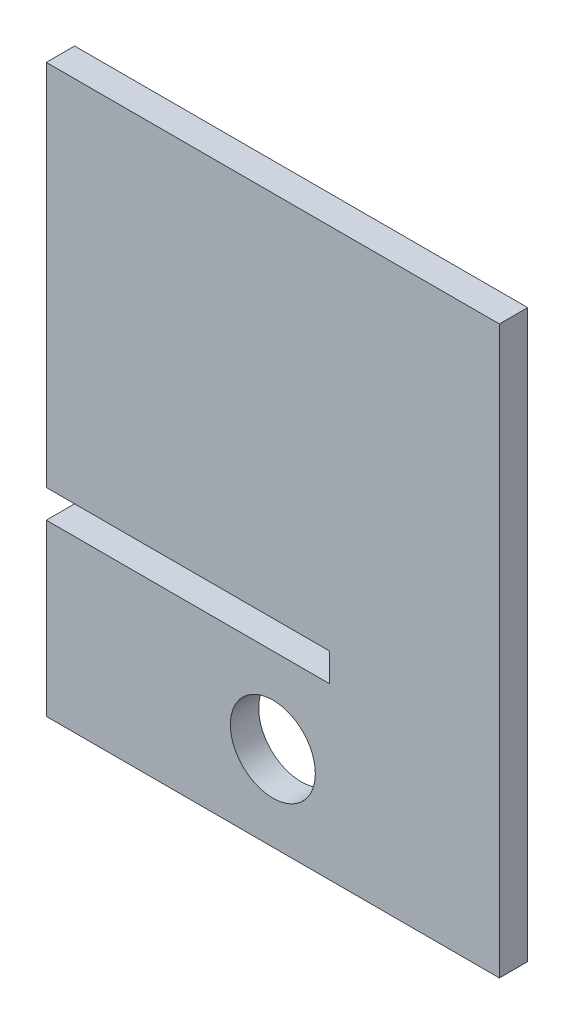
ISO-10303-21;
HEADER;
FILE_DESCRIPTION(('STEP AP214'),'2;1');
FILE_NAME('part.step','',(''),(''),'','','');
FILE_SCHEMA(('AUTOMOTIVE_DESIGN { 1 0 10303 214 1 1 1 1 }'));
ENDSEC;
DATA;
#1=APPLICATION_CONTEXT('core data for automotive mechanical design processes');
#2=APPLICATION_PROTOCOL_DEFINITION('international standard','automotive_design',2000,#1);
#3=PRODUCT_CONTEXT('',#1,'mechanical');
#4=PRODUCT('Part','Part','',(#3));
#5=PRODUCT_RELATED_PRODUCT_CATEGORY('part','',(#4));
#6=PRODUCT_DEFINITION_FORMATION('','',#4);
#7=PRODUCT_DEFINITION_CONTEXT('part definition',#1,'design');
#8=PRODUCT_DEFINITION('design','',#6,#7);
#9=PRODUCT_DEFINITION_SHAPE('','',#8);
#10=(LENGTH_UNIT() NAMED_UNIT(*) SI_UNIT(.MILLI.,.METRE.));
#11=(NAMED_UNIT(*) PLANE_ANGLE_UNIT() SI_UNIT($,.RADIAN.));
#12=(NAMED_UNIT(*) SI_UNIT($,.STERADIAN.) SOLID_ANGLE_UNIT());
#13=UNCERTAINTY_MEASURE_WITH_UNIT(LENGTH_MEASURE(1.E-05),#10,'distance_accuracy_value','');
#14=(GEOMETRIC_REPRESENTATION_CONTEXT(3) GLOBAL_UNCERTAINTY_ASSIGNED_CONTEXT((#13)) GLOBAL_UNIT_ASSIGNED_CONTEXT((#10,
#11,#12)) REPRESENTATION_CONTEXT('',''));
#15=CARTESIAN_POINT('',(0.,0.,0.));
#16=DIRECTION('',(0.,0.,1.));
#17=DIRECTION('',(1.,0.,0.));
#18=AXIS2_PLACEMENT_3D('',#15,#16,#17);
#19=CARTESIAN_POINT('',(0.,0.,5.));
#20=DIRECTION('',(0.,0.,-1.));
#21=DIRECTION('',(-1.,0.,0.));
#22=AXIS2_PLACEMENT_3D('',#19,#20,#21);
#23=PLANE('',#22);
#24=DIRECTION('',(0.,-1.,0.));
#25=VECTOR('',#24,1.);
#26=CARTESIAN_POINT('',(-41.5572539116237,-34.1162467833768,5.));
#27=LINE('',#26,#25);
#28=CARTESIAN_POINT('',(-41.5572539116237,30.8837532166232,5.));
#29=VERTEX_POINT('',#28);
#30=CARTESIAN_POINT('',(-41.5572539116237,-34.1162467833768,5.));
#31=VERTEX_POINT('',#30);
#32=EDGE_CURVE('E145',#29,#31,#27,.T.);
#33=ORIENTED_EDGE('',*,*,#32,.T.);
#34=DIRECTION('',(1.,0.,0.));
#35=VECTOR('',#34,1.);
#36=CARTESIAN_POINT('',(-41.5572539116237,-34.1162467833768,5.));
#37=LINE('',#36,#35);
#38=CARTESIAN_POINT('',(8.44274608837627,-34.1162467833768,5.));
#39=VERTEX_POINT('',#38);
#40=EDGE_CURVE('E93',#31,#39,#37,.T.);
#41=ORIENTED_EDGE('',*,*,#40,.T.);
#42=DIRECTION('',(0.,-1.,0.));
#43=VECTOR('',#42,1.);
#44=CARTESIAN_POINT('',(8.44274608837627,-34.1162467833768,5.));
#45=LINE('',#44,#43);
#46=CARTESIAN_POINT('',(8.44274608837627,-39.1162467833768,5.));
#47=VERTEX_POINT('',#46);
#48=EDGE_CURVE('E160',#39,#47,#45,.T.);
#49=ORIENTED_EDGE('',*,*,#48,.T.);
#50=DIRECTION('',(-1.,0.,0.));
#51=VECTOR('',#50,1.);
#52=CARTESIAN_POINT('',(-41.5572539116237,-39.1162467833768,5.));
#53=LINE('',#52,#51);
#54=CARTESIAN_POINT('',(-41.5572539116237,-39.1162467833768,5.));
#55=VERTEX_POINT('',#54);
#56=EDGE_CURVE('E173',#47,#55,#53,.T.);
#57=ORIENTED_EDGE('',*,*,#56,.T.);
#58=DIRECTION('',(0.,-1.,0.));
#59=VECTOR('',#58,1.);
#60=CARTESIAN_POINT('',(-41.5572539116237,-39.1162467833768,5.));
#61=LINE('',#60,#59);
#62=CARTESIAN_POINT('',(-41.5572539116237,-69.1162467833768,5.));
#63=VERTEX_POINT('',#62);
#64=EDGE_CURVE('E112',#55,#63,#61,.T.);
#65=ORIENTED_EDGE('',*,*,#64,.T.);
#66=DIRECTION('',(1.,0.,0.));
#67=VECTOR('',#66,1.);
#68=CARTESIAN_POINT('',(-41.5572539116237,-69.1162467833768,5.));
#69=LINE('',#68,#67);
#70=CARTESIAN_POINT('',(38.4427460883763,-69.1162467833768,5.));
#71=VERTEX_POINT('',#70);
#72=EDGE_CURVE('E106',#63,#71,#69,.T.);
#73=ORIENTED_EDGE('',*,*,#72,.T.);
#74=DIRECTION('',(0.,1.,0.));
#75=VECTOR('',#74,1.);
#76=CARTESIAN_POINT('',(38.4427460883763,30.8837532166232,5.));
#77=LINE('',#76,#75);
#78=CARTESIAN_POINT('',(38.4427460883763,30.8837532166232,5.));
#79=VERTEX_POINT('',#78);
#80=EDGE_CURVE('E110',#71,#79,#77,.T.);
#81=ORIENTED_EDGE('',*,*,#80,.T.);
#82=DIRECTION('',(-1.,0.,0.));
#83=VECTOR('',#82,1.);
#84=CARTESIAN_POINT('',(-41.5572539116237,30.8837532166232,5.));
#85=LINE('',#84,#83);
#86=EDGE_CURVE('E50',#79,#29,#85,.T.);
#87=ORIENTED_EDGE('',*,*,#86,.T.);
#88=EDGE_LOOP('',(#33,#41,#49,#57,#65,#73,#81,#87));
#89=FACE_BOUND('',#88,.T.);
#90=CARTESIAN_POINT('',(-1.55725391162372,-54.1162467833768,5.));
#91=DIRECTION('',(0.,0.,1.));
#92=DIRECTION('',(1.,0.,0.));
#93=AXIS2_PLACEMENT_3D('',#90,#91,#92);
#94=CIRCLE('',#93,7.5);
#95=CARTESIAN_POINT('',(5.94274608837628,-54.1162467833768,5.));
#96=VERTEX_POINT('',#95);
#97=EDGE_CURVE('E134',#96,#96,#94,.T.);
#98=ORIENTED_EDGE('',*,*,#97,.F.);
#99=EDGE_LOOP('',(#98));
#100=FACE_BOUND('',#99,.T.);
#101=ADVANCED_FACE('F33',(#89,#100),#23,.F.);
#102=CARTESIAN_POINT('',(0.,0.,0.));
#103=DIRECTION('',(0.,0.,-1.));
#104=DIRECTION('',(-1.,0.,0.));
#105=AXIS2_PLACEMENT_3D('',#102,#103,#104);
#106=PLANE('',#105);
#107=DIRECTION('',(0.,-1.,0.));
#108=VECTOR('',#107,1.);
#109=CARTESIAN_POINT('',(-41.5572539116237,-34.1162467833768,0.));
#110=LINE('',#109,#108);
#111=CARTESIAN_POINT('',(-41.5572539116237,30.8837532166232,0.));
#112=VERTEX_POINT('',#111);
#113=CARTESIAN_POINT('',(-41.5572539116237,-34.1162467833768,0.));
#114=VERTEX_POINT('',#113);
#115=EDGE_CURVE('E130',#112,#114,#110,.T.);
#116=ORIENTED_EDGE('',*,*,#115,.F.);
#117=DIRECTION('',(-1.,0.,0.));
#118=VECTOR('',#117,1.);
#119=CARTESIAN_POINT('',(-41.5572539116237,30.8837532166232,0.));
#120=LINE('',#119,#118);
#121=CARTESIAN_POINT('',(38.4427460883763,30.8837532166232,0.));
#122=VERTEX_POINT('',#121);
#123=EDGE_CURVE('E85',#122,#112,#120,.T.);
#124=ORIENTED_EDGE('',*,*,#123,.F.);
#125=DIRECTION('',(0.,1.,0.));
#126=VECTOR('',#125,1.);
#127=CARTESIAN_POINT('',(38.4427460883763,30.8837532166232,0.));
#128=LINE('',#127,#126);
#129=CARTESIAN_POINT('',(38.4427460883763,-69.1162467833768,0.));
#130=VERTEX_POINT('',#129);
#131=EDGE_CURVE('E79',#130,#122,#128,.T.);
#132=ORIENTED_EDGE('',*,*,#131,.F.);
#133=DIRECTION('',(1.,0.,0.));
#134=VECTOR('',#133,1.);
#135=CARTESIAN_POINT('',(-41.5572539116237,-69.1162467833768,0.));
#136=LINE('',#135,#134);
#137=CARTESIAN_POINT('',(-41.5572539116237,-69.1162467833768,0.));
#138=VERTEX_POINT('',#137);
#139=EDGE_CURVE('E120',#138,#130,#136,.T.);
#140=ORIENTED_EDGE('',*,*,#139,.F.);
#141=DIRECTION('',(0.,-1.,0.));
#142=VECTOR('',#141,1.);
#143=CARTESIAN_POINT('',(-41.5572539116237,-39.1162467833768,0.));
#144=LINE('',#143,#142);
#145=CARTESIAN_POINT('',(-41.5572539116237,-39.1162467833768,0.));
#146=VERTEX_POINT('',#145);
#147=EDGE_CURVE('E140',#146,#138,#144,.T.);
#148=ORIENTED_EDGE('',*,*,#147,.F.);
#149=DIRECTION('',(-1.,0.,0.));
#150=VECTOR('',#149,1.);
#151=CARTESIAN_POINT('',(-41.5572539116237,-39.1162467833768,0.));
#152=LINE('',#151,#150);
#153=CARTESIAN_POINT('',(8.44274608837627,-39.1162467833768,0.));
#154=VERTEX_POINT('',#153);
#155=EDGE_CURVE('E138',#154,#146,#152,.T.);
#156=ORIENTED_EDGE('',*,*,#155,.F.);
#157=DIRECTION('',(0.,-1.,0.));
#158=VECTOR('',#157,1.);
#159=CARTESIAN_POINT('',(8.44274608837627,-34.1162467833768,0.));
#160=LINE('',#159,#158);
#161=CARTESIAN_POINT('',(8.44274608837627,-34.1162467833768,0.));
#162=VERTEX_POINT('',#161);
#163=EDGE_CURVE('E136',#162,#154,#160,.T.);
#164=ORIENTED_EDGE('',*,*,#163,.F.);
#165=DIRECTION('',(1.,0.,0.));
#166=VECTOR('',#165,1.);
#167=CARTESIAN_POINT('',(-41.5572539116237,-34.1162467833768,0.));
#168=LINE('',#167,#166);
#169=EDGE_CURVE('E133',#114,#162,#168,.T.);
#170=ORIENTED_EDGE('',*,*,#169,.F.);
#171=EDGE_LOOP('',(#116,#124,#132,#140,#148,#156,#164,#170));
#172=FACE_BOUND('',#171,.T.);
#173=CARTESIAN_POINT('',(-1.55725391162372,-54.1162467833768,0.));
#174=DIRECTION('',(0.,0.,1.));
#175=DIRECTION('',(1.,0.,0.));
#176=AXIS2_PLACEMENT_3D('',#173,#174,#175);
#177=CIRCLE('',#176,7.5);
#178=CARTESIAN_POINT('',(5.94274608837628,-54.1162467833768,0.));
#179=VERTEX_POINT('',#178);
#180=EDGE_CURVE('E179',#179,#179,#177,.T.);
#181=ORIENTED_EDGE('',*,*,#180,.T.);
#182=EDGE_LOOP('',(#181));
#183=FACE_BOUND('',#182,.T.);
#184=ADVANCED_FACE('F164',(#172,#183),#106,.T.);
#185=CARTESIAN_POINT('',(-41.5572539116237,-34.1162467833768,5.));
#186=DIRECTION('',(1.,0.,0.));
#187=DIRECTION('',(0.,1.,0.));
#188=AXIS2_PLACEMENT_3D('',#185,#186,#187);
#189=PLANE('',#188);
#190=ORIENTED_EDGE('',*,*,#115,.T.);
#191=DIRECTION('',(0.,0.,-1.));
#192=VECTOR('',#191,1.);
#193=CARTESIAN_POINT('',(-41.5572539116237,-34.1162467833768,5.));
#194=LINE('',#193,#192);
#195=EDGE_CURVE('E11',#31,#114,#194,.T.);
#196=ORIENTED_EDGE('',*,*,#195,.F.);
#197=ORIENTED_EDGE('',*,*,#32,.F.);
#198=DIRECTION('',(0.,0.,-1.));
#199=VECTOR('',#198,1.);
#200=CARTESIAN_POINT('',(-41.5572539116237,30.8837532166232,5.));
#201=LINE('',#200,#199);
#202=EDGE_CURVE('E126',#29,#112,#201,.T.);
#203=ORIENTED_EDGE('',*,*,#202,.T.);
#204=EDGE_LOOP('',(#190,#196,#197,#203));
#205=FACE_BOUND('',#204,.T.);
#206=ADVANCED_FACE('F35',(#205),#189,.F.);
#207=CARTESIAN_POINT('',(-41.5572539116237,-34.1162467833768,5.));
#208=DIRECTION('',(0.,1.,0.));
#209=DIRECTION('',(0.,0.,1.));
#210=AXIS2_PLACEMENT_3D('',#207,#208,#209);
#211=PLANE('',#210);
#212=ORIENTED_EDGE('',*,*,#169,.T.);
#213=DIRECTION('',(0.,0.,-1.));
#214=VECTOR('',#213,1.);
#215=CARTESIAN_POINT('',(8.44274608837627,-34.1162467833768,5.));
#216=LINE('',#215,#214);
#217=EDGE_CURVE('E42',#39,#162,#216,.T.);
#218=ORIENTED_EDGE('',*,*,#217,.F.);
#219=ORIENTED_EDGE('',*,*,#40,.F.);
#220=ORIENTED_EDGE('',*,*,#195,.T.);
#221=EDGE_LOOP('',(#212,#218,#219,#220));
#222=FACE_BOUND('',#221,.T.);
#223=ADVANCED_FACE('F207',(#222),#211,.F.);
#224=CARTESIAN_POINT('',(8.44274608837627,-34.1162467833768,5.));
#225=DIRECTION('',(1.,0.,0.));
#226=DIRECTION('',(0.,0.,-1.));
#227=AXIS2_PLACEMENT_3D('',#224,#225,#226);
#228=PLANE('',#227);
#229=ORIENTED_EDGE('',*,*,#163,.T.);
#230=DIRECTION('',(0.,0.,-1.));
#231=VECTOR('',#230,1.);
#232=CARTESIAN_POINT('',(8.44274608837627,-39.1162467833768,5.));
#233=LINE('',#232,#231);
#234=EDGE_CURVE('E152',#47,#154,#233,.T.);
#235=ORIENTED_EDGE('',*,*,#234,.F.);
#236=ORIENTED_EDGE('',*,*,#48,.F.);
#237=ORIENTED_EDGE('',*,*,#217,.T.);
#238=EDGE_LOOP('',(#229,#235,#236,#237));
#239=FACE_BOUND('',#238,.T.);
#240=ADVANCED_FACE('F158',(#239),#228,.F.);
#241=CARTESIAN_POINT('',(-41.5572539116237,-39.1162467833768,5.));
#242=DIRECTION('',(0.,-1.,0.));
#243=DIRECTION('',(0.,0.,-1.));
#244=AXIS2_PLACEMENT_3D('',#241,#242,#243);
#245=PLANE('',#244);
#246=ORIENTED_EDGE('',*,*,#155,.T.);
#247=DIRECTION('',(0.,0.,-1.));
#248=VECTOR('',#247,1.);
#249=CARTESIAN_POINT('',(-41.5572539116237,-39.1162467833768,5.));
#250=LINE('',#249,#248);
#251=EDGE_CURVE('E149',#55,#146,#250,.T.);
#252=ORIENTED_EDGE('',*,*,#251,.F.);
#253=ORIENTED_EDGE('',*,*,#56,.F.);
#254=ORIENTED_EDGE('',*,*,#234,.T.);
#255=EDGE_LOOP('',(#246,#252,#253,#254));
#256=FACE_BOUND('',#255,.T.);
#257=ADVANCED_FACE('F169',(#256),#245,.F.);
#258=CARTESIAN_POINT('',(-41.5572539116237,-39.1162467833768,5.));
#259=DIRECTION('',(1.,0.,0.));
#260=DIRECTION('',(0.,1.,0.));
#261=AXIS2_PLACEMENT_3D('',#258,#259,#260);
#262=PLANE('',#261);
#263=ORIENTED_EDGE('',*,*,#147,.T.);
#264=DIRECTION('',(0.,0.,-1.));
#265=VECTOR('',#264,1.);
#266=CARTESIAN_POINT('',(-41.5572539116237,-69.1162467833768,5.));
#267=LINE('',#266,#265);
#268=EDGE_CURVE('E121',#63,#138,#267,.T.);
#269=ORIENTED_EDGE('',*,*,#268,.F.);
#270=ORIENTED_EDGE('',*,*,#64,.F.);
#271=ORIENTED_EDGE('',*,*,#251,.T.);
#272=EDGE_LOOP('',(#263,#269,#270,#271));
#273=FACE_BOUND('',#272,.T.);
#274=ADVANCED_FACE('F172',(#273),#262,.F.);
#275=CARTESIAN_POINT('',(-41.5572539116237,-69.1162467833768,5.));
#276=DIRECTION('',(0.,1.,0.));
#277=DIRECTION('',(0.,0.,1.));
#278=AXIS2_PLACEMENT_3D('',#275,#276,#277);
#279=PLANE('',#278);
#280=ORIENTED_EDGE('',*,*,#139,.T.);
#281=DIRECTION('',(0.,0.,-1.));
#282=VECTOR('',#281,1.);
#283=CARTESIAN_POINT('',(38.4427460883763,-69.1162467833768,5.));
#284=LINE('',#283,#282);
#285=EDGE_CURVE('E117',#71,#130,#284,.T.);
#286=ORIENTED_EDGE('',*,*,#285,.F.);
#287=ORIENTED_EDGE('',*,*,#72,.F.);
#288=ORIENTED_EDGE('',*,*,#268,.T.);
#289=EDGE_LOOP('',(#280,#286,#287,#288));
#290=FACE_BOUND('',#289,.T.);
#291=ADVANCED_FACE('F118',(#290),#279,.F.);
#292=CARTESIAN_POINT('',(38.4427460883763,30.8837532166232,5.));
#293=DIRECTION('',(-1.,0.,0.));
#294=DIRECTION('',(0.,-1.,0.));
#295=AXIS2_PLACEMENT_3D('',#292,#293,#294);
#296=PLANE('',#295);
#297=ORIENTED_EDGE('',*,*,#131,.T.);
#298=DIRECTION('',(0.,0.,-1.));
#299=VECTOR('',#298,1.);
#300=CARTESIAN_POINT('',(38.4427460883763,30.8837532166232,5.));
#301=LINE('',#300,#299);
#302=EDGE_CURVE('E122',#79,#122,#301,.T.);
#303=ORIENTED_EDGE('',*,*,#302,.F.);
#304=ORIENTED_EDGE('',*,*,#80,.F.);
#305=ORIENTED_EDGE('',*,*,#285,.T.);
#306=EDGE_LOOP('',(#297,#303,#304,#305));
#307=FACE_BOUND('',#306,.T.);
#308=ADVANCED_FACE('F124',(#307),#296,.F.);
#309=CARTESIAN_POINT('',(-41.5572539116237,30.8837532166232,5.));
#310=DIRECTION('',(0.,-1.,0.));
#311=DIRECTION('',(0.,0.,-1.));
#312=AXIS2_PLACEMENT_3D('',#309,#310,#311);
#313=PLANE('',#312);
#314=ORIENTED_EDGE('',*,*,#123,.T.);
#315=ORIENTED_EDGE('',*,*,#202,.F.);
#316=ORIENTED_EDGE('',*,*,#86,.F.);
#317=ORIENTED_EDGE('',*,*,#302,.T.);
#318=EDGE_LOOP('',(#314,#315,#316,#317));
#319=FACE_BOUND('',#318,.T.);
#320=ADVANCED_FACE('F195',(#319),#313,.F.);
#321=CARTESIAN_POINT('',(-1.55725391162372,-54.1162467833768,5.));
#322=DIRECTION('',(0.,0.,-1.));
#323=DIRECTION('',(-1.,0.,0.));
#324=AXIS2_PLACEMENT_3D('',#321,#322,#323);
#325=CYLINDRICAL_SURFACE('',#324,7.5);
#326=ORIENTED_EDGE('',*,*,#97,.T.);
#327=EDGE_LOOP('',(#326));
#328=FACE_BOUND('',#327,.T.);
#329=ORIENTED_EDGE('',*,*,#180,.F.);
#330=EDGE_LOOP('',(#329));
#331=FACE_BOUND('',#330,.T.);
#332=ADVANCED_FACE('F185',(#328,#331),#325,.F.);
#333=CLOSED_SHELL('',(#101,#184,#206,#223,#240,#257,#274,#291,#308,#320,#332));
#334=MANIFOLD_SOLID_BREP('B2',#333);
#335=ADVANCED_BREP_SHAPE_REPRESENTATION('',(#18,#334),#14);
#336=SHAPE_DEFINITION_REPRESENTATION(#9,#335);
ENDSEC;
END-ISO-10303-21;
